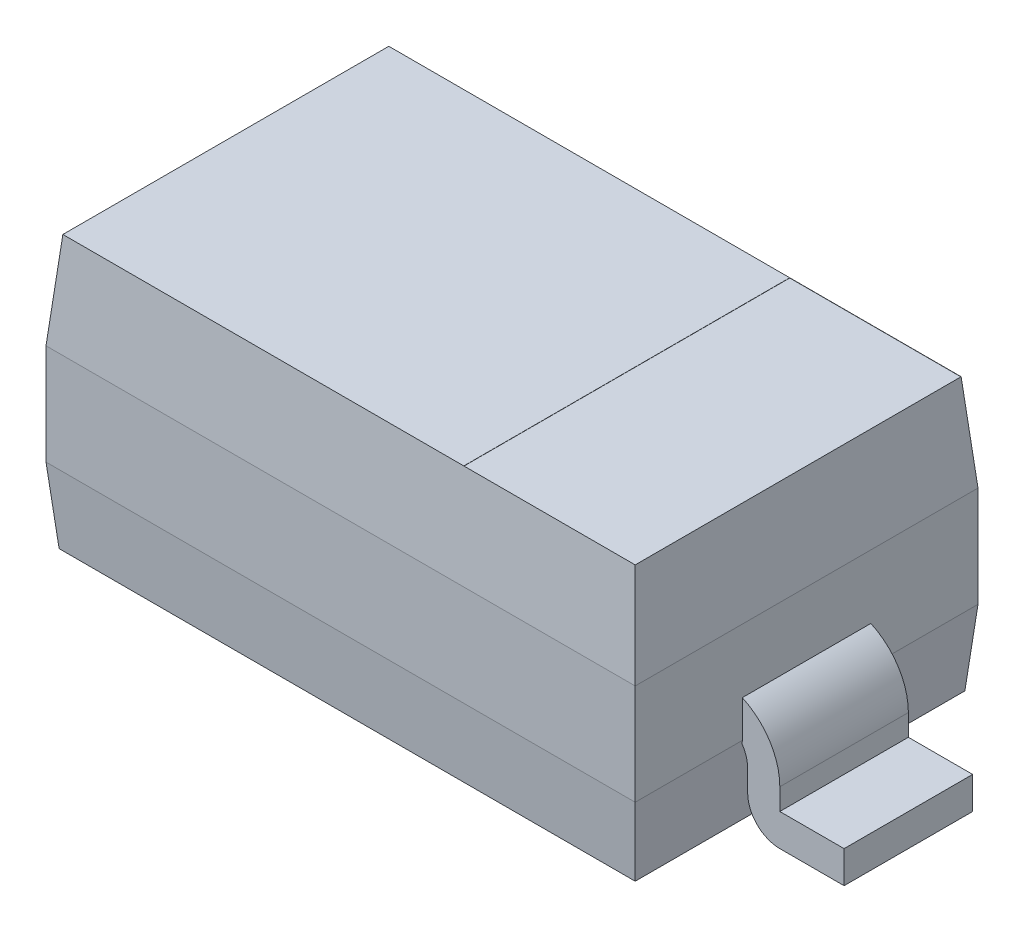
ISO-10303-21;
HEADER;
FILE_DESCRIPTION(('STEP AP214'),'2;1');
FILE_NAME('part.step','',(''),(''),'','','');
FILE_SCHEMA(('AUTOMOTIVE_DESIGN { 1 0 10303 214 1 1 1 1 }'));
ENDSEC;
DATA;
#1=APPLICATION_CONTEXT('core data for automotive mechanical design processes');
#2=APPLICATION_PROTOCOL_DEFINITION('international standard','automotive_design',2000,#1);
#3=PRODUCT_CONTEXT('',#1,'mechanical');
#4=PRODUCT('Part','Part','',(#3));
#5=PRODUCT_RELATED_PRODUCT_CATEGORY('part','',(#4));
#6=PRODUCT_DEFINITION_FORMATION('','',#4);
#7=PRODUCT_DEFINITION_CONTEXT('part definition',#1,'design');
#8=PRODUCT_DEFINITION('design','',#6,#7);
#9=PRODUCT_DEFINITION_SHAPE('','',#8);
#10=(LENGTH_UNIT() NAMED_UNIT(*) SI_UNIT(.MILLI.,.METRE.));
#11=(NAMED_UNIT(*) PLANE_ANGLE_UNIT() SI_UNIT($,.RADIAN.));
#12=(NAMED_UNIT(*) SI_UNIT($,.STERADIAN.) SOLID_ANGLE_UNIT());
#13=UNCERTAINTY_MEASURE_WITH_UNIT(LENGTH_MEASURE(1.E-05),#10,'distance_accuracy_value','');
#14=(GEOMETRIC_REPRESENTATION_CONTEXT(3) GLOBAL_UNCERTAINTY_ASSIGNED_CONTEXT((#13)) GLOBAL_UNIT_ASSIGNED_CONTEXT((#10,
#11,#12)) REPRESENTATION_CONTEXT('',''));
#15=CARTESIAN_POINT('',(0.,0.,0.));
#16=DIRECTION('',(0.,0.,1.));
#17=DIRECTION('',(1.,0.,0.));
#18=AXIS2_PLACEMENT_3D('',#15,#16,#17);
#19=CARTESIAN_POINT('',(-1.375,1.27,-0.8));
#20=DIRECTION('',(1.,0.,0.));
#21=DIRECTION('',(0.,0.,-1.));
#22=AXIS2_PLACEMENT_3D('',#19,#20,#21);
#23=PLANE('',#22);
#24=DIRECTION('',(0.,1.,0.));
#25=VECTOR('',#24,1.);
#26=CARTESIAN_POINT('',(-1.375,1.27,0.3));
#27=LINE('',#26,#25);
#28=CARTESIAN_POINT('',(-1.375,0.350000000000015,0.3));
#29=VERTEX_POINT('',#28);
#30=CARTESIAN_POINT('',(-1.375,0.522717802865893,0.3));
#31=VERTEX_POINT('',#30);
#32=EDGE_CURVE('E392',#29,#31,#27,.T.);
#33=ORIENTED_EDGE('',*,*,#32,.F.);
#34=DIRECTION('',(0.,0.,1.));
#35=VECTOR('',#34,1.);
#36=CARTESIAN_POINT('',(-1.375,0.350000000000015,-0.8));
#37=LINE('',#36,#35);
#38=CARTESIAN_POINT('',(-1.375,0.350000000000015,0.8));
#39=VERTEX_POINT('',#38);
#40=EDGE_CURVE('E463',#29,#39,#37,.T.);
#41=ORIENTED_EDGE('',*,*,#40,.T.);
#42=DIRECTION('',(0.,-1.,0.));
#43=VECTOR('',#42,1.);
#44=CARTESIAN_POINT('',(-1.375,1.27,0.8));
#45=LINE('',#44,#43);
#46=CARTESIAN_POINT('',(-1.375,0.819999999999983,0.8));
#47=VERTEX_POINT('',#46);
#48=EDGE_CURVE('E410',#47,#39,#45,.T.);
#49=ORIENTED_EDGE('',*,*,#48,.F.);
#50=DIRECTION('',(0.,0.,-1.));
#51=VECTOR('',#50,1.);
#52=CARTESIAN_POINT('',(-1.375,0.819999999999983,-0.8));
#53=LINE('',#52,#51);
#54=CARTESIAN_POINT('',(-1.375,0.819999999999983,-0.8));
#55=VERTEX_POINT('',#54);
#56=EDGE_CURVE('E426',#47,#55,#53,.T.);
#57=ORIENTED_EDGE('',*,*,#56,.T.);
#58=DIRECTION('',(0.,-1.,0.));
#59=VECTOR('',#58,1.);
#60=CARTESIAN_POINT('',(-1.375,1.27,-0.8));
#61=LINE('',#60,#59);
#62=CARTESIAN_POINT('',(-1.375,0.350000000000015,-0.8));
#63=VERTEX_POINT('',#62);
#64=EDGE_CURVE('E400',#55,#63,#61,.T.);
#65=ORIENTED_EDGE('',*,*,#64,.T.);
#66=CARTESIAN_POINT('',(-1.375,0.350000000000015,-0.3));
#67=VERTEX_POINT('',#66);
#68=EDGE_CURVE('E464',#63,#67,#37,.T.);
#69=ORIENTED_EDGE('',*,*,#68,.T.);
#70=DIRECTION('',(0.,1.,0.));
#71=VECTOR('',#70,1.);
#72=CARTESIAN_POINT('',(-1.375,1.27,-0.3));
#73=LINE('',#72,#71);
#74=CARTESIAN_POINT('',(-1.375,0.522717802865893,-0.3));
#75=VERTEX_POINT('',#74);
#76=EDGE_CURVE('E384',#67,#75,#73,.T.);
#77=ORIENTED_EDGE('',*,*,#76,.T.);
#78=DIRECTION('',(0.,0.,-1.));
#79=VECTOR('',#78,1.);
#80=CARTESIAN_POINT('',(-1.375,0.522717802865893,0.3));
#81=LINE('',#80,#79);
#82=EDGE_CURVE('E11',#31,#75,#81,.T.);
#83=ORIENTED_EDGE('',*,*,#82,.F.);
#84=EDGE_LOOP('',(#33,#41,#49,#57,#65,#69,#77,#83));
#85=FACE_BOUND('',#84,.T.);
#86=ADVANCED_FACE('F33',(#85),#23,.F.);
#87=CARTESIAN_POINT('',(1.375,1.27,-0.8));
#88=DIRECTION('',(-1.,0.,0.));
#89=DIRECTION('',(0.,0.,1.));
#90=AXIS2_PLACEMENT_3D('',#87,#88,#89);
#91=PLANE('',#90);
#92=DIRECTION('',(0.,-1.,0.));
#93=VECTOR('',#92,1.);
#94=CARTESIAN_POINT('',(1.375,1.27,0.3));
#95=LINE('',#94,#93);
#96=CARTESIAN_POINT('',(1.375,0.522717802865893,0.3));
#97=VERTEX_POINT('',#96);
#98=CARTESIAN_POINT('',(1.375,0.350000000000015,0.3));
#99=VERTEX_POINT('',#98);
#100=EDGE_CURVE('E396',#97,#99,#95,.T.);
#101=ORIENTED_EDGE('',*,*,#100,.F.);
#102=DIRECTION('',(0.,0.,-1.));
#103=VECTOR('',#102,1.);
#104=CARTESIAN_POINT('',(1.375,0.522717802865893,0.3));
#105=LINE('',#104,#103);
#106=CARTESIAN_POINT('',(1.375,0.522717802865893,-0.3));
#107=VERTEX_POINT('',#106);
#108=EDGE_CURVE('E41',#107,#97,#105,.F.);
#109=ORIENTED_EDGE('',*,*,#108,.F.);
#110=DIRECTION('',(0.,-1.,0.));
#111=VECTOR('',#110,1.);
#112=CARTESIAN_POINT('',(1.375,1.27,-0.3));
#113=LINE('',#112,#111);
#114=CARTESIAN_POINT('',(1.375,0.350000000000015,-0.3));
#115=VERTEX_POINT('',#114);
#116=EDGE_CURVE('E389',#107,#115,#113,.T.);
#117=ORIENTED_EDGE('',*,*,#116,.T.);
#118=DIRECTION('',(0.,0.,-1.));
#119=VECTOR('',#118,1.);
#120=CARTESIAN_POINT('',(1.375,0.350000000000015,-0.8));
#121=LINE('',#120,#119);
#122=CARTESIAN_POINT('',(1.375,0.350000000000015,-0.8));
#123=VERTEX_POINT('',#122);
#124=EDGE_CURVE('E457',#115,#123,#121,.T.);
#125=ORIENTED_EDGE('',*,*,#124,.T.);
#126=DIRECTION('',(0.,-1.,0.));
#127=VECTOR('',#126,1.);
#128=CARTESIAN_POINT('',(1.375,1.27,-0.8));
#129=LINE('',#128,#127);
#130=CARTESIAN_POINT('',(1.375,0.819999999999983,-0.8));
#131=VERTEX_POINT('',#130);
#132=EDGE_CURVE('E403',#131,#123,#129,.T.);
#133=ORIENTED_EDGE('',*,*,#132,.F.);
#134=DIRECTION('',(0.,0.,1.));
#135=VECTOR('',#134,1.);
#136=CARTESIAN_POINT('',(1.375,0.819999999999983,0.8));
#137=LINE('',#136,#135);
#138=CARTESIAN_POINT('',(1.375,0.819999999999983,0.8));
#139=VERTEX_POINT('',#138);
#140=EDGE_CURVE('E431',#131,#139,#137,.T.);
#141=ORIENTED_EDGE('',*,*,#140,.T.);
#142=DIRECTION('',(0.,-1.,0.));
#143=VECTOR('',#142,1.);
#144=CARTESIAN_POINT('',(1.375,1.27,0.8));
#145=LINE('',#144,#143);
#146=CARTESIAN_POINT('',(1.375,0.350000000000015,0.8));
#147=VERTEX_POINT('',#146);
#148=EDGE_CURVE('E407',#139,#147,#145,.T.);
#149=ORIENTED_EDGE('',*,*,#148,.T.);
#150=EDGE_CURVE('E458',#147,#99,#121,.T.);
#151=ORIENTED_EDGE('',*,*,#150,.T.);
#152=EDGE_LOOP('',(#101,#109,#117,#125,#133,#141,#149,#151));
#153=FACE_BOUND('',#152,.T.);
#154=ADVANCED_FACE('F506',(#153),#91,.F.);
#155=CARTESIAN_POINT('',(1.375,0.350000000000015,-0.8));
#156=DIRECTION('',(-0.996194698091746,0.0871557427476553,0.));
#157=DIRECTION('',(-0.0871557427476553,-0.996194698091746,0.));
#158=AXIS2_PLACEMENT_3D('',#155,#156,#157);
#159=PLANE('',#158);
#160=DIRECTION('',(0.,0.,-1.));
#161=VECTOR('',#160,1.);
#162=CARTESIAN_POINT('',(1.37367687103119,0.334876566683237,0.3));
#163=LINE('',#162,#161);
#164=CARTESIAN_POINT('',(1.37367687103119,0.334876566683237,0.3));
#165=VERTEX_POINT('',#164);
#166=CARTESIAN_POINT('',(1.37367687103119,0.334876566683237,-0.3));
#167=VERTEX_POINT('',#166);
#168=EDGE_CURVE('E483',#165,#167,#163,.T.);
#169=ORIENTED_EDGE('',*,*,#168,.F.);
#170=DIRECTION('',(-0.0871557427476553,-0.996194698091746,0.));
#171=VECTOR('',#170,1.);
#172=CARTESIAN_POINT('',(1.375,0.350000000000015,0.3));
#173=LINE('',#172,#171);
#174=EDGE_CURVE('E394',#165,#99,#173,.F.);
#175=ORIENTED_EDGE('',*,*,#174,.T.);
#176=ORIENTED_EDGE('',*,*,#150,.F.);
#177=DIRECTION('',(0.0868265938642448,0.992432509138968,0.0868265938642442));
#178=VECTOR('',#177,1.);
#179=CARTESIAN_POINT('',(1.35426814214432,0.113033780376138,0.779268142144317));
#180=LINE('',#179,#178);
#181=CARTESIAN_POINT('',(1.34437896776593,0.,0.769378967765927));
#182=VERTEX_POINT('',#181);
#183=EDGE_CURVE('E439',#147,#182,#180,.F.);
#184=ORIENTED_EDGE('',*,*,#183,.T.);
#185=DIRECTION('',(0.,0.,1.));
#186=VECTOR('',#185,1.);
#187=CARTESIAN_POINT('',(1.34437896776593,0.,0.8));
#188=LINE('',#187,#186);
#189=CARTESIAN_POINT('',(1.34437896776593,0.,-0.769378967765927));
#190=VERTEX_POINT('',#189);
#191=EDGE_CURVE('E452',#190,#182,#188,.T.);
#192=ORIENTED_EDGE('',*,*,#191,.F.);
#193=DIRECTION('',(0.0868265938642448,0.992432509138968,-0.0868265938642442));
#194=VECTOR('',#193,1.);
#195=CARTESIAN_POINT('',(1.375,0.350000000000015,-0.8));
#196=LINE('',#195,#194);
#197=EDGE_CURVE('E469',#123,#190,#196,.F.);
#198=ORIENTED_EDGE('',*,*,#197,.F.);
#199=ORIENTED_EDGE('',*,*,#124,.F.);
#200=DIRECTION('',(-0.0871557427476553,-0.996194698091746,0.));
#201=VECTOR('',#200,1.);
#202=CARTESIAN_POINT('',(1.375,0.350000000000015,-0.3));
#203=LINE('',#202,#201);
#204=EDGE_CURVE('E386',#167,#115,#203,.F.);
#205=ORIENTED_EDGE('',*,*,#204,.F.);
#206=EDGE_LOOP('',(#169,#175,#176,#184,#192,#198,#199,#205));
#207=FACE_BOUND('',#206,.T.);
#208=ADVANCED_FACE('F517',(#207),#159,.F.);
#209=CARTESIAN_POINT('',(-1.375,0.350000000000015,-0.8));
#210=DIRECTION('',(0.996194698091746,0.0871557427476547,0.));
#211=DIRECTION('',(-0.0871557427476547,0.996194698091746,0.));
#212=AXIS2_PLACEMENT_3D('',#209,#210,#211);
#213=PLANE('',#212);
#214=ORIENTED_EDGE('',*,*,#40,.F.);
#215=DIRECTION('',(-0.0871557427476547,0.996194698091746,0.));
#216=VECTOR('',#215,1.);
#217=CARTESIAN_POINT('',(-1.375,0.350000000000015,0.3));
#218=LINE('',#217,#216);
#219=CARTESIAN_POINT('',(-1.37367687103119,0.334876566683237,0.3));
#220=VERTEX_POINT('',#219);
#221=EDGE_CURVE('E481',#29,#220,#218,.F.);
#222=ORIENTED_EDGE('',*,*,#221,.T.);
#223=DIRECTION('',(0.,0.,-1.));
#224=VECTOR('',#223,1.);
#225=CARTESIAN_POINT('',(-1.37367687103119,0.334876566683237,0.3));
#226=LINE('',#225,#224);
#227=CARTESIAN_POINT('',(-1.37367687103119,0.334876566683237,-0.3));
#228=VERTEX_POINT('',#227);
#229=EDGE_CURVE('E478',#228,#220,#226,.F.);
#230=ORIENTED_EDGE('',*,*,#229,.F.);
#231=DIRECTION('',(-0.0871557427476547,0.996194698091746,0.));
#232=VECTOR('',#231,1.);
#233=CARTESIAN_POINT('',(-1.375,0.350000000000015,-0.3));
#234=LINE('',#233,#232);
#235=EDGE_CURVE('E467',#67,#228,#234,.F.);
#236=ORIENTED_EDGE('',*,*,#235,.F.);
#237=ORIENTED_EDGE('',*,*,#68,.F.);
#238=DIRECTION('',(0.0868265938642442,-0.992432509138968,0.0868265938642442));
#239=VECTOR('',#238,1.);
#240=CARTESIAN_POINT('',(-1.375,0.350000000000015,-0.8));
#241=LINE('',#240,#239);
#242=CARTESIAN_POINT('',(-1.34437896776593,0.,-0.769378967765927));
#243=VERTEX_POINT('',#242);
#244=EDGE_CURVE('E399',#243,#63,#241,.F.);
#245=ORIENTED_EDGE('',*,*,#244,.F.);
#246=DIRECTION('',(0.,0.,-1.));
#247=VECTOR('',#246,1.);
#248=CARTESIAN_POINT('',(-1.34437896776593,0.,0.8));
#249=LINE('',#248,#247);
#250=CARTESIAN_POINT('',(-1.34437896776593,0.,0.769378967765927));
#251=VERTEX_POINT('',#250);
#252=EDGE_CURVE('E448',#251,#243,#249,.T.);
#253=ORIENTED_EDGE('',*,*,#252,.F.);
#254=DIRECTION('',(-0.0868265938642442,0.992432509138968,0.0868265938642442));
#255=VECTOR('',#254,1.);
#256=CARTESIAN_POINT('',(-1.36293782815669,0.212128744946124,0.787937828156694));
#257=LINE('',#256,#255);
#258=EDGE_CURVE('E471',#251,#39,#257,.T.);
#259=ORIENTED_EDGE('',*,*,#258,.T.);
#260=EDGE_LOOP('',(#214,#222,#230,#236,#237,#245,#253,#259));
#261=FACE_BOUND('',#260,.T.);
#262=ADVANCED_FACE('F526',(#261),#213,.F.);
#263=CARTESIAN_POINT('',(-1.375,1.27,0.8));
#264=DIRECTION('',(0.,0.,-1.));
#265=DIRECTION('',(-1.,0.,0.));
#266=AXIS2_PLACEMENT_3D('',#263,#264,#265);
#267=PLANE('',#266);
#268=ORIENTED_EDGE('',*,*,#48,.T.);
#269=DIRECTION('',(1.,0.,0.));
#270=VECTOR('',#269,1.);
#271=CARTESIAN_POINT('',(-1.375,0.350000000000015,0.8));
#272=LINE('',#271,#270);
#273=EDGE_CURVE('E461',#39,#147,#272,.T.);
#274=ORIENTED_EDGE('',*,*,#273,.T.);
#275=ORIENTED_EDGE('',*,*,#148,.F.);
#276=DIRECTION('',(-1.,0.,0.));
#277=VECTOR('',#276,1.);
#278=CARTESIAN_POINT('',(-1.375,0.819999999999983,0.8));
#279=LINE('',#278,#277);
#280=EDGE_CURVE('E429',#139,#47,#279,.T.);
#281=ORIENTED_EDGE('',*,*,#280,.T.);
#282=EDGE_LOOP('',(#268,#274,#275,#281));
#283=FACE_BOUND('',#282,.T.);
#284=ADVANCED_FACE('F558',(#283),#267,.F.);
#285=CARTESIAN_POINT('',(-1.375,1.27,-0.8));
#286=DIRECTION('',(0.,0.,1.));
#287=DIRECTION('',(1.,0.,0.));
#288=AXIS2_PLACEMENT_3D('',#285,#286,#287);
#289=PLANE('',#288);
#290=ORIENTED_EDGE('',*,*,#132,.T.);
#291=DIRECTION('',(-1.,0.,0.));
#292=VECTOR('',#291,1.);
#293=CARTESIAN_POINT('',(-1.375,0.350000000000015,-0.8));
#294=LINE('',#293,#292);
#295=EDGE_CURVE('E435',#123,#63,#294,.T.);
#296=ORIENTED_EDGE('',*,*,#295,.T.);
#297=ORIENTED_EDGE('',*,*,#64,.F.);
#298=DIRECTION('',(1.,0.,0.));
#299=VECTOR('',#298,1.);
#300=CARTESIAN_POINT('',(1.375,0.819999999999983,-0.8));
#301=LINE('',#300,#299);
#302=EDGE_CURVE('E433',#55,#131,#301,.T.);
#303=ORIENTED_EDGE('',*,*,#302,.T.);
#304=EDGE_LOOP('',(#290,#296,#297,#303));
#305=FACE_BOUND('',#304,.T.);
#306=ADVANCED_FACE('F512',(#305),#289,.F.);
#307=CARTESIAN_POINT('',(-1.375,1.27,0.8));
#308=DIRECTION('',(0.,1.,0.));
#309=DIRECTION('',(0.,0.,1.));
#310=AXIS2_PLACEMENT_3D('',#307,#308,#309);
#311=PLANE('',#310);
#312=DIRECTION('',(0.,0.,1.));
#313=VECTOR('',#312,1.);
#314=CARTESIAN_POINT('',(0.535630101413334,1.27,0.760630101413334));
#315=LINE('',#314,#313);
#316=CARTESIAN_POINT('',(0.535630101413334,1.27,-0.760630101413334));
#317=VERTEX_POINT('',#316);
#318=CARTESIAN_POINT('',(0.535630101413334,1.27,0.760630101413334));
#319=VERTEX_POINT('',#318);
#320=EDGE_CURVE('E48',#317,#319,#315,.T.);
#321=ORIENTED_EDGE('',*,*,#320,.F.);
#322=DIRECTION('',(-1.,0.,0.));
#323=VECTOR('',#322,1.);
#324=CARTESIAN_POINT('',(-1.375,1.27,-0.760630101413334));
#325=LINE('',#324,#323);
#326=CARTESIAN_POINT('',(-1.33563010141333,1.27,-0.760630101413334));
#327=VERTEX_POINT('',#326);
#328=EDGE_CURVE('E413',#317,#327,#325,.T.);
#329=ORIENTED_EDGE('',*,*,#328,.T.);
#330=DIRECTION('',(0.,0.,1.));
#331=VECTOR('',#330,1.);
#332=CARTESIAN_POINT('',(-1.33563010141333,1.27,0.8));
#333=LINE('',#332,#331);
#334=CARTESIAN_POINT('',(-1.33563010141333,1.27,0.760630101413334));
#335=VERTEX_POINT('',#334);
#336=EDGE_CURVE('E423',#327,#335,#333,.T.);
#337=ORIENTED_EDGE('',*,*,#336,.T.);
#338=DIRECTION('',(1.,0.,0.));
#339=VECTOR('',#338,1.);
#340=CARTESIAN_POINT('',(1.375,1.27,0.760630101413334));
#341=LINE('',#340,#339);
#342=EDGE_CURVE('E420',#335,#319,#341,.T.);
#343=ORIENTED_EDGE('',*,*,#342,.T.);
#344=EDGE_LOOP('',(#321,#329,#337,#343));
#345=FACE_BOUND('',#344,.T.);
#346=ADVANCED_FACE('F573',(#345),#311,.T.);
#347=CARTESIAN_POINT('',(-1.375,0.,0.8));
#348=DIRECTION('',(0.,1.,0.));
#349=DIRECTION('',(0.,0.,1.));
#350=AXIS2_PLACEMENT_3D('',#347,#348,#349);
#351=PLANE('',#350);
#352=ORIENTED_EDGE('',*,*,#252,.T.);
#353=DIRECTION('',(1.,0.,0.));
#354=VECTOR('',#353,1.);
#355=CARTESIAN_POINT('',(-1.375,0.,-0.769378967765927));
#356=LINE('',#355,#354);
#357=EDGE_CURVE('E454',#243,#190,#356,.T.);
#358=ORIENTED_EDGE('',*,*,#357,.T.);
#359=ORIENTED_EDGE('',*,*,#191,.T.);
#360=DIRECTION('',(-1.,0.,0.));
#361=VECTOR('',#360,1.);
#362=CARTESIAN_POINT('',(-1.375,0.,0.769378967765927));
#363=LINE('',#362,#361);
#364=EDGE_CURVE('E450',#182,#251,#363,.T.);
#365=ORIENTED_EDGE('',*,*,#364,.T.);
#366=EDGE_LOOP('',(#352,#358,#359,#365));
#367=FACE_BOUND('',#366,.T.);
#368=ADVANCED_FACE('F607',(#367),#351,.F.);
#369=CARTESIAN_POINT('',(1.33563010141333,1.27,0.8));
#370=DIRECTION('',(0.996194698091746,0.0871557427476554,0.));
#371=DIRECTION('',(-0.0871557427476554,0.996194698091746,0.));
#372=AXIS2_PLACEMENT_3D('',#369,#370,#371);
#373=PLANE('',#372);
#374=DIRECTION('',(0.0868265938642448,-0.992432509138968,0.0868265938642444));
#375=VECTOR('',#374,1.);
#376=CARTESIAN_POINT('',(1.33592690546471,1.26660751416907,0.760926905464713));
#377=LINE('',#376,#375);
#378=CARTESIAN_POINT('',(1.33563010141333,1.27,0.760630101413334));
#379=VERTEX_POINT('',#378);
#380=EDGE_CURVE('E441',#139,#379,#377,.F.);
#381=ORIENTED_EDGE('',*,*,#380,.F.);
#382=ORIENTED_EDGE('',*,*,#140,.F.);
#383=DIRECTION('',(0.0868265938642448,-0.992432509138968,-0.0868265938642444));
#384=VECTOR('',#383,1.);
#385=CARTESIAN_POINT('',(1.31519504760903,1.50357373379295,-0.74019504760903));
#386=LINE('',#385,#384);
#387=CARTESIAN_POINT('',(1.33563010141333,1.27,-0.760630101413334));
#388=VERTEX_POINT('',#387);
#389=EDGE_CURVE('E404',#388,#131,#386,.T.);
#390=ORIENTED_EDGE('',*,*,#389,.F.);
#391=DIRECTION('',(0.,0.,-1.));
#392=VECTOR('',#391,1.);
#393=CARTESIAN_POINT('',(1.33563010141333,1.27,-0.8));
#394=LINE('',#393,#392);
#395=EDGE_CURVE('E417',#379,#388,#394,.T.);
#396=ORIENTED_EDGE('',*,*,#395,.F.);
#397=EDGE_LOOP('',(#381,#382,#390,#396));
#398=FACE_BOUND('',#397,.T.);
#399=ADVANCED_FACE('F562',(#398),#373,.T.);
#400=CARTESIAN_POINT('',(-1.375,1.27,-0.760630101413334));
#401=DIRECTION('',(0.,0.0871557427476549,-0.996194698091746));
#402=DIRECTION('',(0.,0.996194698091746,0.0871557427476549));
#403=AXIS2_PLACEMENT_3D('',#400,#401,#402);
#404=PLANE('',#403);
#405=ORIENTED_EDGE('',*,*,#389,.T.);
#406=ORIENTED_EDGE('',*,*,#302,.F.);
#407=DIRECTION('',(0.0868265938642444,0.992432509138968,0.0868265938642444));
#408=VECTOR('',#407,1.);
#409=CARTESIAN_POINT('',(-1.33592690546471,1.26660751416907,-0.760926905464713));
#410=LINE('',#409,#408);
#411=EDGE_CURVE('E438',#327,#55,#410,.F.);
#412=ORIENTED_EDGE('',*,*,#411,.F.);
#413=ORIENTED_EDGE('',*,*,#328,.F.);
#414=EDGE_CURVE('E414',#388,#317,#325,.T.);
#415=ORIENTED_EDGE('',*,*,#414,.F.);
#416=EDGE_LOOP('',(#405,#406,#412,#413,#415));
#417=FACE_BOUND('',#416,.T.);
#418=ADVANCED_FACE('F567',(#417),#404,.T.);
#419=CARTESIAN_POINT('',(-1.375,1.27,0.760630101413334));
#420=DIRECTION('',(0.,0.0871557427476549,0.996194698091746));
#421=DIRECTION('',(0.,-0.996194698091746,0.0871557427476549));
#422=AXIS2_PLACEMENT_3D('',#419,#420,#421);
#423=PLANE('',#422);
#424=ORIENTED_EDGE('',*,*,#380,.T.);
#425=DIRECTION('',(1.,0.,0.));
#426=VECTOR('',#425,1.);
#427=CARTESIAN_POINT('',(0.535630101413334,1.27,0.760630101413334));
#428=LINE('',#427,#426);
#429=EDGE_CURVE('E254',#319,#379,#428,.T.);
#430=ORIENTED_EDGE('',*,*,#429,.F.);
#431=ORIENTED_EDGE('',*,*,#342,.F.);
#432=DIRECTION('',(-0.0868265938642444,-0.992432509138968,0.0868265938642444));
#433=VECTOR('',#432,1.);
#434=CARTESIAN_POINT('',(-1.33592690546471,1.26660751416907,0.760926905464713));
#435=LINE('',#434,#433);
#436=EDGE_CURVE('E436',#47,#335,#435,.F.);
#437=ORIENTED_EDGE('',*,*,#436,.F.);
#438=ORIENTED_EDGE('',*,*,#280,.F.);
#439=EDGE_LOOP('',(#424,#430,#431,#437,#438));
#440=FACE_BOUND('',#439,.T.);
#441=ADVANCED_FACE('F578',(#440),#423,.T.);
#442=CARTESIAN_POINT('',(-1.33563010141333,1.27,0.8));
#443=DIRECTION('',(-0.996194698091746,0.0871557427476549,0.));
#444=DIRECTION('',(-0.0871557427476549,-0.996194698091746,0.));
#445=AXIS2_PLACEMENT_3D('',#442,#443,#444);
#446=PLANE('',#445);
#447=ORIENTED_EDGE('',*,*,#411,.T.);
#448=ORIENTED_EDGE('',*,*,#56,.F.);
#449=ORIENTED_EDGE('',*,*,#436,.T.);
#450=ORIENTED_EDGE('',*,*,#336,.F.);
#451=EDGE_LOOP('',(#447,#448,#449,#450));
#452=FACE_BOUND('',#451,.T.);
#453=ADVANCED_FACE('F597',(#452),#446,.T.);
#454=CARTESIAN_POINT('',(-1.375,0.350000000000015,0.8));
#455=DIRECTION('',(0.,0.0871557427476547,-0.996194698091746));
#456=DIRECTION('',(0.,0.996194698091746,0.0871557427476547));
#457=AXIS2_PLACEMENT_3D('',#454,#455,#456);
#458=PLANE('',#457);
#459=ORIENTED_EDGE('',*,*,#258,.F.);
#460=ORIENTED_EDGE('',*,*,#364,.F.);
#461=ORIENTED_EDGE('',*,*,#183,.F.);
#462=ORIENTED_EDGE('',*,*,#273,.F.);
#463=EDGE_LOOP('',(#459,#460,#461,#462));
#464=FACE_BOUND('',#463,.T.);
#465=ADVANCED_FACE('F35',(#464),#458,.F.);
#466=CARTESIAN_POINT('',(-1.375,0.350000000000015,-0.8));
#467=DIRECTION('',(0.,0.0871557427476547,0.996194698091746));
#468=DIRECTION('',(0.,-0.996194698091746,0.0871557427476547));
#469=AXIS2_PLACEMENT_3D('',#466,#467,#468);
#470=PLANE('',#469);
#471=ORIENTED_EDGE('',*,*,#197,.T.);
#472=ORIENTED_EDGE('',*,*,#357,.F.);
#473=ORIENTED_EDGE('',*,*,#244,.T.);
#474=ORIENTED_EDGE('',*,*,#295,.F.);
#475=EDGE_LOOP('',(#471,#472,#473,#474));
#476=FACE_BOUND('',#475,.T.);
#477=ADVANCED_FACE('F520',(#476),#470,.F.);
#478=CARTESIAN_POINT('',(-1.55,0.250000000000001,0.3));
#479=DIRECTION('',(1.,0.,0.));
#480=DIRECTION('',(0.,1.,0.));
#481=AXIS2_PLACEMENT_3D('',#478,#479,#480);
#482=PLANE('',#481);
#483=DIRECTION('',(0.,0.,-1.));
#484=VECTOR('',#483,1.);
#485=CARTESIAN_POINT('',(-1.55,0.250000000000001,0.3));
#486=LINE('',#485,#484);
#487=CARTESIAN_POINT('',(-1.55,0.250000000000001,0.3));
#488=VERTEX_POINT('',#487);
#489=CARTESIAN_POINT('',(-1.55,0.250000000000001,-0.3));
#490=VERTEX_POINT('',#489);
#491=EDGE_CURVE('E356',#488,#490,#486,.T.);
#492=ORIENTED_EDGE('',*,*,#491,.T.);
#493=DIRECTION('',(0.,-1.,0.));
#494=VECTOR('',#493,1.);
#495=CARTESIAN_POINT('',(-1.55,0.250000000000001,-0.3));
#496=LINE('',#495,#494);
#497=CARTESIAN_POINT('',(-1.55,0.15,-0.3));
#498=VERTEX_POINT('',#497);
#499=EDGE_CURVE('E309',#490,#498,#496,.T.);
#500=ORIENTED_EDGE('',*,*,#499,.T.);
#501=DIRECTION('',(0.,0.,-1.));
#502=VECTOR('',#501,1.);
#503=CARTESIAN_POINT('',(-1.55,0.15,0.3));
#504=LINE('',#503,#502);
#505=CARTESIAN_POINT('',(-1.55,0.15,0.3));
#506=VERTEX_POINT('',#505);
#507=EDGE_CURVE('E354',#506,#498,#504,.T.);
#508=ORIENTED_EDGE('',*,*,#507,.F.);
#509=DIRECTION('',(0.,-1.,0.));
#510=VECTOR('',#509,1.);
#511=CARTESIAN_POINT('',(-1.55,0.250000000000001,0.3));
#512=LINE('',#511,#510);
#513=EDGE_CURVE('E352',#488,#506,#512,.T.);
#514=ORIENTED_EDGE('',*,*,#513,.F.);
#515=EDGE_LOOP('',(#492,#500,#508,#514));
#516=FACE_BOUND('',#515,.T.);
#517=ADVANCED_FACE('F540',(#516),#482,.F.);
#518=CARTESIAN_POINT('',(-1.55,0.15,0.3));
#519=DIRECTION('',(0.,-1.,0.));
#520=DIRECTION('',(1.,0.,0.));
#521=AXIS2_PLACEMENT_3D('',#518,#519,#520);
#522=PLANE('',#521);
#523=ORIENTED_EDGE('',*,*,#507,.T.);
#524=DIRECTION('',(-1.,0.,0.));
#525=VECTOR('',#524,1.);
#526=CARTESIAN_POINT('',(-1.55,0.15,-0.3));
#527=LINE('',#526,#525);
#528=CARTESIAN_POINT('',(-1.85,0.149999999999999,-0.3));
#529=VERTEX_POINT('',#528);
#530=EDGE_CURVE('E263',#498,#529,#527,.T.);
#531=ORIENTED_EDGE('',*,*,#530,.T.);
#532=DIRECTION('',(0.,0.,-1.));
#533=VECTOR('',#532,1.);
#534=CARTESIAN_POINT('',(-1.85,0.149999999999999,0.3));
#535=LINE('',#534,#533);
#536=CARTESIAN_POINT('',(-1.85,0.149999999999999,0.3));
#537=VERTEX_POINT('',#536);
#538=EDGE_CURVE('E382',#537,#529,#535,.T.);
#539=ORIENTED_EDGE('',*,*,#538,.F.);
#540=DIRECTION('',(-1.,0.,0.));
#541=VECTOR('',#540,1.);
#542=CARTESIAN_POINT('',(-1.55,0.15,0.3));
#543=LINE('',#542,#541);
#544=EDGE_CURVE('E312',#506,#537,#543,.T.);
#545=ORIENTED_EDGE('',*,*,#544,.F.);
#546=EDGE_LOOP('',(#523,#531,#539,#545));
#547=FACE_BOUND('',#546,.T.);
#548=ADVANCED_FACE('F678',(#547),#522,.F.);
#549=CARTESIAN_POINT('',(-1.85,0.,0.3));
#550=DIRECTION('',(-1.,0.,0.));
#551=DIRECTION('',(0.,-1.,0.));
#552=AXIS2_PLACEMENT_3D('',#549,#550,#551);
#553=PLANE('',#552);
#554=ORIENTED_EDGE('',*,*,#538,.T.);
#555=DIRECTION('',(0.,1.,0.));
#556=VECTOR('',#555,1.);
#557=CARTESIAN_POINT('',(-1.85,0.,-0.3));
#558=LINE('',#557,#556);
#559=CARTESIAN_POINT('',(-1.85,0.,-0.3));
#560=VERTEX_POINT('',#559);
#561=EDGE_CURVE('E269',#560,#529,#558,.T.);
#562=ORIENTED_EDGE('',*,*,#561,.F.);
#563=DIRECTION('',(0.,0.,-1.));
#564=VECTOR('',#563,1.);
#565=CARTESIAN_POINT('',(-1.85,0.,0.3));
#566=LINE('',#565,#564);
#567=CARTESIAN_POINT('',(-1.85,0.,0.3));
#568=VERTEX_POINT('',#567);
#569=EDGE_CURVE('E380',#568,#560,#566,.T.);
#570=ORIENTED_EDGE('',*,*,#569,.F.);
#571=DIRECTION('',(0.,1.,0.));
#572=VECTOR('',#571,1.);
#573=CARTESIAN_POINT('',(-1.85,0.,0.3));
#574=LINE('',#573,#572);
#575=EDGE_CURVE('E314',#568,#537,#574,.T.);
#576=ORIENTED_EDGE('',*,*,#575,.T.);
#577=EDGE_LOOP('',(#554,#562,#570,#576));
#578=FACE_BOUND('',#577,.T.);
#579=ADVANCED_FACE('F685',(#578),#553,.T.);
#580=CARTESIAN_POINT('',(-1.55,0.,0.3));
#581=DIRECTION('',(0.,-1.,0.));
#582=DIRECTION('',(1.,0.,0.));
#583=AXIS2_PLACEMENT_3D('',#580,#581,#582);
#584=PLANE('',#583);
#585=ORIENTED_EDGE('',*,*,#569,.T.);
#586=DIRECTION('',(-1.,0.,0.));
#587=VECTOR('',#586,1.);
#588=CARTESIAN_POINT('',(-1.55,0.,-0.3));
#589=LINE('',#588,#587);
#590=CARTESIAN_POINT('',(-1.55,0.,-0.3));
#591=VERTEX_POINT('',#590);
#592=EDGE_CURVE('E272',#591,#560,#589,.T.);
#593=ORIENTED_EDGE('',*,*,#592,.F.);
#594=DIRECTION('',(0.,0.,-1.));
#595=VECTOR('',#594,1.);
#596=CARTESIAN_POINT('',(-1.55,0.,0.3));
#597=LINE('',#596,#595);
#598=CARTESIAN_POINT('',(-1.55,0.,0.3));
#599=VERTEX_POINT('',#598);
#600=EDGE_CURVE('E378',#599,#591,#597,.T.);
#601=ORIENTED_EDGE('',*,*,#600,.F.);
#602=DIRECTION('',(-1.,0.,0.));
#603=VECTOR('',#602,1.);
#604=CARTESIAN_POINT('',(-1.55,0.,0.3));
#605=LINE('',#604,#603);
#606=EDGE_CURVE('E317',#599,#568,#605,.T.);
#607=ORIENTED_EDGE('',*,*,#606,.T.);
#608=EDGE_LOOP('',(#585,#593,#601,#607));
#609=FACE_BOUND('',#608,.T.);
#610=ADVANCED_FACE('F693',(#609),#584,.T.);
#611=CARTESIAN_POINT('',(-1.55,0.15,0.3));
#612=DIRECTION('',(0.,0.,-1.));
#613=DIRECTION('',(-1.,0.,0.));
#614=AXIS2_PLACEMENT_3D('',#611,#612,#613);
#615=CYLINDRICAL_SURFACE('',#614,0.15);
#616=ORIENTED_EDGE('',*,*,#600,.T.);
#617=CARTESIAN_POINT('',(-1.55,0.15,-0.3));
#618=DIRECTION('',(0.,0.,-1.));
#619=DIRECTION('',(-1.,0.,0.));
#620=AXIS2_PLACEMENT_3D('',#617,#618,#619);
#621=CIRCLE('',#620,0.15);
#622=CARTESIAN_POINT('',(-1.4,0.15,-0.3));
#623=VERTEX_POINT('',#622);
#624=EDGE_CURVE('E275',#623,#591,#621,.T.);
#625=ORIENTED_EDGE('',*,*,#624,.F.);
#626=DIRECTION('',(0.,0.,-1.));
#627=VECTOR('',#626,1.);
#628=CARTESIAN_POINT('',(-1.4,0.15,0.3));
#629=LINE('',#628,#627);
#630=CARTESIAN_POINT('',(-1.4,0.15,0.3));
#631=VERTEX_POINT('',#630);
#632=EDGE_CURVE('E376',#631,#623,#629,.T.);
#633=ORIENTED_EDGE('',*,*,#632,.F.);
#634=CARTESIAN_POINT('',(-1.55,0.15,0.3));
#635=DIRECTION('',(0.,0.,-1.));
#636=DIRECTION('',(-1.,0.,0.));
#637=AXIS2_PLACEMENT_3D('',#634,#635,#636);
#638=CIRCLE('',#637,0.15);
#639=EDGE_CURVE('E320',#631,#599,#638,.T.);
#640=ORIENTED_EDGE('',*,*,#639,.T.);
#641=EDGE_LOOP('',(#616,#625,#633,#640));
#642=FACE_BOUND('',#641,.T.);
#643=ADVANCED_FACE('F701',(#642),#615,.T.);
#644=CARTESIAN_POINT('',(-1.4,0.25,0.3));
#645=DIRECTION('',(1.,0.,0.));
#646=DIRECTION('',(0.,1.,0.));
#647=AXIS2_PLACEMENT_3D('',#644,#645,#646);
#648=PLANE('',#647);
#649=ORIENTED_EDGE('',*,*,#632,.T.);
#650=DIRECTION('',(0.,-1.,0.));
#651=VECTOR('',#650,1.);
#652=CARTESIAN_POINT('',(-1.4,0.25,-0.3));
#653=LINE('',#652,#651);
#654=CARTESIAN_POINT('',(-1.4,0.25,-0.3));
#655=VERTEX_POINT('',#654);
#656=EDGE_CURVE('E278',#655,#623,#653,.T.);
#657=ORIENTED_EDGE('',*,*,#656,.F.);
#658=DIRECTION('',(0.,0.,-1.));
#659=VECTOR('',#658,1.);
#660=CARTESIAN_POINT('',(-1.4,0.25,0.3));
#661=LINE('',#660,#659);
#662=CARTESIAN_POINT('',(-1.4,0.25,0.3));
#663=VERTEX_POINT('',#662);
#664=EDGE_CURVE('E373',#663,#655,#661,.T.);
#665=ORIENTED_EDGE('',*,*,#664,.F.);
#666=DIRECTION('',(0.,-1.,0.));
#667=VECTOR('',#666,1.);
#668=CARTESIAN_POINT('',(-1.4,0.25,0.3));
#669=LINE('',#668,#667);
#670=EDGE_CURVE('E323',#663,#631,#669,.T.);
#671=ORIENTED_EDGE('',*,*,#670,.T.);
#672=EDGE_LOOP('',(#649,#657,#665,#671));
#673=FACE_BOUND('',#672,.T.);
#674=ADVANCED_FACE('F709',(#673),#648,.T.);
#675=CARTESIAN_POINT('',(-1.55,0.15,0.3));
#676=DIRECTION('',(0.,0.,-1.));
#677=DIRECTION('',(-1.,0.,0.));
#678=AXIS2_PLACEMENT_3D('',#675,#676,#677);
#679=PLANE('',#678);
#680=ORIENTED_EDGE('',*,*,#221,.F.);
#681=ORIENTED_EDGE('',*,*,#32,.T.);
#682=CARTESIAN_POINT('',(-1.25,0.25,0.3));
#683=DIRECTION('',(0.,0.,1.));
#684=DIRECTION('',(1.,0.,0.));
#685=AXIS2_PLACEMENT_3D('',#682,#683,#684);
#686=CIRCLE('',#685,0.3);
#687=EDGE_CURVE('E350',#31,#488,#686,.T.);
#688=ORIENTED_EDGE('',*,*,#687,.T.);
#689=ORIENTED_EDGE('',*,*,#513,.T.);
#690=ORIENTED_EDGE('',*,*,#544,.T.);
#691=ORIENTED_EDGE('',*,*,#575,.F.);
#692=ORIENTED_EDGE('',*,*,#606,.F.);
#693=ORIENTED_EDGE('',*,*,#639,.F.);
#694=ORIENTED_EDGE('',*,*,#670,.F.);
#695=CARTESIAN_POINT('',(-1.25,0.25,0.3));
#696=DIRECTION('',(0.,0.,1.));
#697=DIRECTION('',(1.,0.,0.));
#698=AXIS2_PLACEMENT_3D('',#695,#696,#697);
#699=CIRCLE('',#698,0.15);
#700=EDGE_CURVE('E326',#220,#663,#699,.T.);
#701=ORIENTED_EDGE('',*,*,#700,.F.);
#702=EDGE_LOOP('',(#680,#681,#688,#689,#690,#691,#692,#693,#694,#701));
#703=FACE_BOUND('',#702,.T.);
#704=ADVANCED_FACE('F545',(#703),#679,.F.);
#705=CARTESIAN_POINT('',(-1.55,0.15,-0.3));
#706=DIRECTION('',(0.,0.,-1.));
#707=DIRECTION('',(-1.,0.,0.));
#708=AXIS2_PLACEMENT_3D('',#705,#706,#707);
#709=PLANE('',#708);
#710=ORIENTED_EDGE('',*,*,#76,.F.);
#711=ORIENTED_EDGE('',*,*,#235,.T.);
#712=CARTESIAN_POINT('',(-1.25,0.25,-0.3));
#713=DIRECTION('',(0.,0.,1.));
#714=DIRECTION('',(1.,0.,0.));
#715=AXIS2_PLACEMENT_3D('',#712,#713,#714);
#716=CIRCLE('',#715,0.15);
#717=EDGE_CURVE('E281',#228,#655,#716,.T.);
#718=ORIENTED_EDGE('',*,*,#717,.T.);
#719=ORIENTED_EDGE('',*,*,#656,.T.);
#720=ORIENTED_EDGE('',*,*,#624,.T.);
#721=ORIENTED_EDGE('',*,*,#592,.T.);
#722=ORIENTED_EDGE('',*,*,#561,.T.);
#723=ORIENTED_EDGE('',*,*,#530,.F.);
#724=ORIENTED_EDGE('',*,*,#499,.F.);
#725=CARTESIAN_POINT('',(-1.25,0.25,-0.3));
#726=DIRECTION('',(0.,0.,1.));
#727=DIRECTION('',(1.,0.,0.));
#728=AXIS2_PLACEMENT_3D('',#725,#726,#727);
#729=CIRCLE('',#728,0.3);
#730=EDGE_CURVE('E307',#75,#490,#729,.T.);
#731=ORIENTED_EDGE('',*,*,#730,.F.);
#732=EDGE_LOOP('',(#710,#711,#718,#719,#720,#721,#722,#723,#724,#731));
#733=FACE_BOUND('',#732,.T.);
#734=ADVANCED_FACE('F530',(#733),#709,.T.);
#735=CARTESIAN_POINT('',(-1.25,0.25,0.3));
#736=DIRECTION('',(0.,0.,-1.));
#737=DIRECTION('',(-1.,0.,0.));
#738=AXIS2_PLACEMENT_3D('',#735,#736,#737);
#739=CYLINDRICAL_SURFACE('',#738,0.15);
#740=ORIENTED_EDGE('',*,*,#717,.F.);
#741=ORIENTED_EDGE('',*,*,#229,.T.);
#742=ORIENTED_EDGE('',*,*,#700,.T.);
#743=ORIENTED_EDGE('',*,*,#664,.T.);
#744=EDGE_LOOP('',(#740,#741,#742,#743));
#745=FACE_BOUND('',#744,.T.);
#746=ADVANCED_FACE('F731',(#745),#739,.F.);
#747=CARTESIAN_POINT('',(-1.25,0.25,0.3));
#748=DIRECTION('',(0.,0.,-1.));
#749=DIRECTION('',(-1.,0.,0.));
#750=AXIS2_PLACEMENT_3D('',#747,#748,#749);
#751=CYLINDRICAL_SURFACE('',#750,0.3);
#752=ORIENTED_EDGE('',*,*,#687,.F.);
#753=ORIENTED_EDGE('',*,*,#82,.T.);
#754=ORIENTED_EDGE('',*,*,#730,.T.);
#755=ORIENTED_EDGE('',*,*,#491,.F.);
#756=EDGE_LOOP('',(#752,#753,#754,#755));
#757=FACE_BOUND('',#756,.T.);
#758=ADVANCED_FACE('F537',(#757),#751,.T.);
#759=CARTESIAN_POINT('',(1.25,0.25,0.3));
#760=DIRECTION('',(0.,0.,-1.));
#761=DIRECTION('',(-1.,0.,0.));
#762=AXIS2_PLACEMENT_3D('',#759,#760,#761);
#763=CYLINDRICAL_SURFACE('',#762,0.3);
#764=CARTESIAN_POINT('',(1.25,0.25,-0.3));
#765=DIRECTION('',(0.,0.,1.));
#766=DIRECTION('',(1.,0.,0.));
#767=AXIS2_PLACEMENT_3D('',#764,#765,#766);
#768=CIRCLE('',#767,0.3);
#769=CARTESIAN_POINT('',(1.55,0.25,-0.3));
#770=VERTEX_POINT('',#769);
#771=EDGE_CURVE('E304',#770,#107,#768,.T.);
#772=ORIENTED_EDGE('',*,*,#771,.T.);
#773=ORIENTED_EDGE('',*,*,#108,.T.);
#774=CARTESIAN_POINT('',(1.25,0.25,0.3));
#775=DIRECTION('',(0.,0.,1.));
#776=DIRECTION('',(1.,0.,0.));
#777=AXIS2_PLACEMENT_3D('',#774,#775,#776);
#778=CIRCLE('',#777,0.3);
#779=CARTESIAN_POINT('',(1.55,0.25,0.3));
#780=VERTEX_POINT('',#779);
#781=EDGE_CURVE('E347',#780,#97,#778,.T.);
#782=ORIENTED_EDGE('',*,*,#781,.F.);
#783=DIRECTION('',(0.,0.,-1.));
#784=VECTOR('',#783,1.);
#785=CARTESIAN_POINT('',(1.55,0.25,0.3));
#786=LINE('',#785,#784);
#787=EDGE_CURVE('E359',#780,#770,#786,.T.);
#788=ORIENTED_EDGE('',*,*,#787,.T.);
#789=EDGE_LOOP('',(#772,#773,#782,#788));
#790=FACE_BOUND('',#789,.T.);
#791=ADVANCED_FACE('F488',(#790),#763,.T.);
#792=ORIENTED_EDGE('',*,*,#781,.T.);
#793=ORIENTED_EDGE('',*,*,#100,.T.);
#794=ORIENTED_EDGE('',*,*,#174,.F.);
#795=CARTESIAN_POINT('',(1.25,0.25,0.3));
#796=DIRECTION('',(0.,0.,1.));
#797=DIRECTION('',(1.,0.,0.));
#798=AXIS2_PLACEMENT_3D('',#795,#796,#797);
#799=CIRCLE('',#798,0.15);
#800=CARTESIAN_POINT('',(1.4,0.25,0.3));
#801=VERTEX_POINT('',#800);
#802=EDGE_CURVE('E328',#801,#165,#799,.T.);
#803=ORIENTED_EDGE('',*,*,#802,.F.);
#804=DIRECTION('',(0.,1.,0.));
#805=VECTOR('',#804,1.);
#806=CARTESIAN_POINT('',(1.4,0.25,0.3));
#807=LINE('',#806,#805);
#808=CARTESIAN_POINT('',(1.4,0.15,0.3));
#809=VERTEX_POINT('',#808);
#810=EDGE_CURVE('E331',#809,#801,#807,.T.);
#811=ORIENTED_EDGE('',*,*,#810,.F.);
#812=CARTESIAN_POINT('',(1.55,0.15,0.3));
#813=DIRECTION('',(0.,0.,-1.));
#814=DIRECTION('',(-1.,0.,0.));
#815=AXIS2_PLACEMENT_3D('',#812,#813,#814);
#816=CIRCLE('',#815,0.15);
#817=CARTESIAN_POINT('',(1.55,0.,0.3));
#818=VERTEX_POINT('',#817);
#819=EDGE_CURVE('E334',#818,#809,#816,.T.);
#820=ORIENTED_EDGE('',*,*,#819,.F.);
#821=DIRECTION('',(-1.,0.,0.));
#822=VECTOR('',#821,1.);
#823=CARTESIAN_POINT('',(1.55,0.,0.3));
#824=LINE('',#823,#822);
#825=CARTESIAN_POINT('',(1.85,0.,0.3));
#826=VERTEX_POINT('',#825);
#827=EDGE_CURVE('E337',#826,#818,#824,.T.);
#828=ORIENTED_EDGE('',*,*,#827,.F.);
#829=DIRECTION('',(0.,-1.,0.));
#830=VECTOR('',#829,1.);
#831=CARTESIAN_POINT('',(1.85,0.149999999999999,0.3));
#832=LINE('',#831,#830);
#833=CARTESIAN_POINT('',(1.85,0.149999999999999,0.3));
#834=VERTEX_POINT('',#833);
#835=EDGE_CURVE('E340',#834,#826,#832,.T.);
#836=ORIENTED_EDGE('',*,*,#835,.F.);
#837=DIRECTION('',(-1.,0.,0.));
#838=VECTOR('',#837,1.);
#839=CARTESIAN_POINT('',(1.55,0.15,0.3));
#840=LINE('',#839,#838);
#841=CARTESIAN_POINT('',(1.55,0.15,0.3));
#842=VERTEX_POINT('',#841);
#843=EDGE_CURVE('E343',#834,#842,#840,.T.);
#844=ORIENTED_EDGE('',*,*,#843,.T.);
#845=DIRECTION('',(0.,1.,0.));
#846=VECTOR('',#845,1.);
#847=CARTESIAN_POINT('',(1.55,0.250000000000001,0.3));
#848=LINE('',#847,#846);
#849=EDGE_CURVE('E345',#842,#780,#848,.T.);
#850=ORIENTED_EDGE('',*,*,#849,.T.);
#851=EDGE_LOOP('',(#792,#793,#794,#803,#811,#820,#828,#836,#844,#850));
#852=FACE_BOUND('',#851,.T.);
#853=ADVANCED_FACE('F493',(#852),#679,.F.);
#854=ORIENTED_EDGE('',*,*,#116,.F.);
#855=ORIENTED_EDGE('',*,*,#771,.F.);
#856=DIRECTION('',(0.,1.,0.));
#857=VECTOR('',#856,1.);
#858=CARTESIAN_POINT('',(1.55,0.250000000000001,-0.3));
#859=LINE('',#858,#857);
#860=CARTESIAN_POINT('',(1.55,0.15,-0.3));
#861=VERTEX_POINT('',#860);
#862=EDGE_CURVE('E301',#861,#770,#859,.T.);
#863=ORIENTED_EDGE('',*,*,#862,.F.);
#864=DIRECTION('',(-1.,0.,0.));
#865=VECTOR('',#864,1.);
#866=CARTESIAN_POINT('',(1.55,0.15,-0.3));
#867=LINE('',#866,#865);
#868=CARTESIAN_POINT('',(1.85,0.149999999999999,-0.3));
#869=VERTEX_POINT('',#868);
#870=EDGE_CURVE('E298',#869,#861,#867,.T.);
#871=ORIENTED_EDGE('',*,*,#870,.F.);
#872=DIRECTION('',(0.,-1.,0.));
#873=VECTOR('',#872,1.);
#874=CARTESIAN_POINT('',(1.85,0.149999999999999,-0.3));
#875=LINE('',#874,#873);
#876=CARTESIAN_POINT('',(1.85,0.,-0.3));
#877=VERTEX_POINT('',#876);
#878=EDGE_CURVE('E295',#869,#877,#875,.T.);
#879=ORIENTED_EDGE('',*,*,#878,.T.);
#880=DIRECTION('',(-1.,0.,0.));
#881=VECTOR('',#880,1.);
#882=CARTESIAN_POINT('',(1.55,0.,-0.3));
#883=LINE('',#882,#881);
#884=CARTESIAN_POINT('',(1.55,0.,-0.3));
#885=VERTEX_POINT('',#884);
#886=EDGE_CURVE('E292',#877,#885,#883,.T.);
#887=ORIENTED_EDGE('',*,*,#886,.T.);
#888=CARTESIAN_POINT('',(1.55,0.15,-0.3));
#889=DIRECTION('',(0.,0.,-1.));
#890=DIRECTION('',(-1.,0.,0.));
#891=AXIS2_PLACEMENT_3D('',#888,#889,#890);
#892=CIRCLE('',#891,0.15);
#893=CARTESIAN_POINT('',(1.4,0.15,-0.3));
#894=VERTEX_POINT('',#893);
#895=EDGE_CURVE('E289',#885,#894,#892,.T.);
#896=ORIENTED_EDGE('',*,*,#895,.T.);
#897=DIRECTION('',(0.,1.,0.));
#898=VECTOR('',#897,1.);
#899=CARTESIAN_POINT('',(1.4,0.25,-0.3));
#900=LINE('',#899,#898);
#901=CARTESIAN_POINT('',(1.4,0.25,-0.3));
#902=VERTEX_POINT('',#901);
#903=EDGE_CURVE('E286',#894,#902,#900,.T.);
#904=ORIENTED_EDGE('',*,*,#903,.T.);
#905=CARTESIAN_POINT('',(1.25,0.25,-0.3));
#906=DIRECTION('',(0.,0.,1.));
#907=DIRECTION('',(1.,0.,0.));
#908=AXIS2_PLACEMENT_3D('',#905,#906,#907);
#909=CIRCLE('',#908,0.15);
#910=EDGE_CURVE('E283',#902,#167,#909,.T.);
#911=ORIENTED_EDGE('',*,*,#910,.T.);
#912=ORIENTED_EDGE('',*,*,#204,.T.);
#913=EDGE_LOOP('',(#854,#855,#863,#871,#879,#887,#896,#904,#911,#912));
#914=FACE_BOUND('',#913,.T.);
#915=ADVANCED_FACE('F504',(#914),#709,.T.);
#916=CARTESIAN_POINT('',(1.25,0.25,0.3));
#917=DIRECTION('',(0.,0.,-1.));
#918=DIRECTION('',(-1.,0.,0.));
#919=AXIS2_PLACEMENT_3D('',#916,#917,#918);
#920=CYLINDRICAL_SURFACE('',#919,0.15);
#921=ORIENTED_EDGE('',*,*,#802,.T.);
#922=ORIENTED_EDGE('',*,*,#168,.T.);
#923=ORIENTED_EDGE('',*,*,#910,.F.);
#924=DIRECTION('',(0.,0.,-1.));
#925=VECTOR('',#924,1.);
#926=CARTESIAN_POINT('',(1.4,0.25,0.3));
#927=LINE('',#926,#925);
#928=EDGE_CURVE('E371',#801,#902,#927,.T.);
#929=ORIENTED_EDGE('',*,*,#928,.F.);
#930=EDGE_LOOP('',(#921,#922,#923,#929));
#931=FACE_BOUND('',#930,.T.);
#932=ADVANCED_FACE('F762',(#931),#920,.F.);
#933=CARTESIAN_POINT('',(1.4,0.25,0.3));
#934=DIRECTION('',(-1.,0.,0.));
#935=DIRECTION('',(0.,-1.,0.));
#936=AXIS2_PLACEMENT_3D('',#933,#934,#935);
#937=PLANE('',#936);
#938=ORIENTED_EDGE('',*,*,#928,.T.);
#939=ORIENTED_EDGE('',*,*,#903,.F.);
#940=DIRECTION('',(0.,0.,-1.));
#941=VECTOR('',#940,1.);
#942=CARTESIAN_POINT('',(1.4,0.15,0.3));
#943=LINE('',#942,#941);
#944=EDGE_CURVE('E369',#809,#894,#943,.T.);
#945=ORIENTED_EDGE('',*,*,#944,.F.);
#946=ORIENTED_EDGE('',*,*,#810,.T.);
#947=EDGE_LOOP('',(#938,#939,#945,#946));
#948=FACE_BOUND('',#947,.T.);
#949=ADVANCED_FACE('F768',(#948),#937,.T.);
#950=CARTESIAN_POINT('',(1.55,0.15,0.3));
#951=DIRECTION('',(0.,0.,-1.));
#952=DIRECTION('',(-1.,0.,0.));
#953=AXIS2_PLACEMENT_3D('',#950,#951,#952);
#954=CYLINDRICAL_SURFACE('',#953,0.15);
#955=ORIENTED_EDGE('',*,*,#944,.T.);
#956=ORIENTED_EDGE('',*,*,#895,.F.);
#957=DIRECTION('',(0.,0.,-1.));
#958=VECTOR('',#957,1.);
#959=CARTESIAN_POINT('',(1.55,0.,0.3));
#960=LINE('',#959,#958);
#961=EDGE_CURVE('E367',#818,#885,#960,.T.);
#962=ORIENTED_EDGE('',*,*,#961,.F.);
#963=ORIENTED_EDGE('',*,*,#819,.T.);
#964=EDGE_LOOP('',(#955,#956,#962,#963));
#965=FACE_BOUND('',#964,.T.);
#966=ADVANCED_FACE('F776',(#965),#954,.T.);
#967=CARTESIAN_POINT('',(1.55,0.,0.3));
#968=DIRECTION('',(0.,-1.,0.));
#969=DIRECTION('',(1.,0.,0.));
#970=AXIS2_PLACEMENT_3D('',#967,#968,#969);
#971=PLANE('',#970);
#972=ORIENTED_EDGE('',*,*,#961,.T.);
#973=ORIENTED_EDGE('',*,*,#886,.F.);
#974=DIRECTION('',(0.,0.,-1.));
#975=VECTOR('',#974,1.);
#976=CARTESIAN_POINT('',(1.85,0.,0.3));
#977=LINE('',#976,#975);
#978=EDGE_CURVE('E365',#826,#877,#977,.T.);
#979=ORIENTED_EDGE('',*,*,#978,.F.);
#980=ORIENTED_EDGE('',*,*,#827,.T.);
#981=EDGE_LOOP('',(#972,#973,#979,#980));
#982=FACE_BOUND('',#981,.T.);
#983=ADVANCED_FACE('F784',(#982),#971,.T.);
#984=CARTESIAN_POINT('',(1.85,0.149999999999999,0.3));
#985=DIRECTION('',(1.,0.,0.));
#986=DIRECTION('',(0.,1.,0.));
#987=AXIS2_PLACEMENT_3D('',#984,#985,#986);
#988=PLANE('',#987);
#989=ORIENTED_EDGE('',*,*,#978,.T.);
#990=ORIENTED_EDGE('',*,*,#878,.F.);
#991=DIRECTION('',(0.,0.,-1.));
#992=VECTOR('',#991,1.);
#993=CARTESIAN_POINT('',(1.85,0.149999999999999,0.3));
#994=LINE('',#993,#992);
#995=EDGE_CURVE('E363',#834,#869,#994,.T.);
#996=ORIENTED_EDGE('',*,*,#995,.F.);
#997=ORIENTED_EDGE('',*,*,#835,.T.);
#998=EDGE_LOOP('',(#989,#990,#996,#997));
#999=FACE_BOUND('',#998,.T.);
#1000=ADVANCED_FACE('F791',(#999),#988,.T.);
#1001=CARTESIAN_POINT('',(1.55,0.15,0.3));
#1002=DIRECTION('',(0.,-1.,0.));
#1003=DIRECTION('',(1.,0.,0.));
#1004=AXIS2_PLACEMENT_3D('',#1001,#1002,#1003);
#1005=PLANE('',#1004);
#1006=ORIENTED_EDGE('',*,*,#995,.T.);
#1007=ORIENTED_EDGE('',*,*,#870,.T.);
#1008=DIRECTION('',(0.,0.,-1.));
#1009=VECTOR('',#1008,1.);
#1010=CARTESIAN_POINT('',(1.55,0.15,0.3));
#1011=LINE('',#1010,#1009);
#1012=EDGE_CURVE('E361',#842,#861,#1011,.T.);
#1013=ORIENTED_EDGE('',*,*,#1012,.F.);
#1014=ORIENTED_EDGE('',*,*,#843,.F.);
#1015=EDGE_LOOP('',(#1006,#1007,#1013,#1014));
#1016=FACE_BOUND('',#1015,.T.);
#1017=ADVANCED_FACE('F799',(#1016),#1005,.F.);
#1018=CARTESIAN_POINT('',(1.55,0.250000000000001,0.3));
#1019=DIRECTION('',(-1.,0.,0.));
#1020=DIRECTION('',(0.,-1.,0.));
#1021=AXIS2_PLACEMENT_3D('',#1018,#1019,#1020);
#1022=PLANE('',#1021);
#1023=ORIENTED_EDGE('',*,*,#1012,.T.);
#1024=ORIENTED_EDGE('',*,*,#862,.T.);
#1025=ORIENTED_EDGE('',*,*,#787,.F.);
#1026=ORIENTED_EDGE('',*,*,#849,.F.);
#1027=EDGE_LOOP('',(#1023,#1024,#1025,#1026));
#1028=FACE_BOUND('',#1027,.T.);
#1029=ADVANCED_FACE('F501',(#1028),#1022,.F.);
#1030=CARTESIAN_POINT('',(0.535630101413334,1.269,0.760630101413334));
#1031=DIRECTION('',(-1.,0.,0.));
#1032=DIRECTION('',(0.,0.,1.));
#1033=AXIS2_PLACEMENT_3D('',#1030,#1031,#1032);
#1034=PLANE('',#1033);
#1035=ORIENTED_EDGE('',*,*,#320,.T.);
#1036=DIRECTION('',(0.,1.,0.));
#1037=VECTOR('',#1036,1.);
#1038=CARTESIAN_POINT('',(0.535630101413334,1.269,0.760630101413334));
#1039=LINE('',#1038,#1037);
#1040=CARTESIAN_POINT('',(0.535630101413334,1.269,0.760630101413334));
#1041=VERTEX_POINT('',#1040);
#1042=EDGE_CURVE('E232',#1041,#319,#1039,.T.);
#1043=ORIENTED_EDGE('',*,*,#1042,.F.);
#1044=DIRECTION('',(0.,0.,1.));
#1045=VECTOR('',#1044,1.);
#1046=CARTESIAN_POINT('',(0.535630101413334,1.269,0.760630101413334));
#1047=LINE('',#1046,#1045);
#1048=CARTESIAN_POINT('',(0.535630101413334,1.269,-0.760630101413334));
#1049=VERTEX_POINT('',#1048);
#1050=EDGE_CURVE('E236',#1049,#1041,#1047,.T.);
#1051=ORIENTED_EDGE('',*,*,#1050,.F.);
#1052=DIRECTION('',(0.,1.,0.));
#1053=VECTOR('',#1052,1.);
#1054=CARTESIAN_POINT('',(0.535630101413334,1.269,-0.760630101413334));
#1055=LINE('',#1054,#1053);
#1056=EDGE_CURVE('E261',#1049,#317,#1055,.T.);
#1057=ORIENTED_EDGE('',*,*,#1056,.T.);
#1058=EDGE_LOOP('',(#1035,#1043,#1051,#1057));
#1059=FACE_BOUND('',#1058,.T.);
#1060=ADVANCED_FACE('F234',(#1059),#1034,.F.);
#1061=CARTESIAN_POINT('',(0.535630101413334,1.269,-0.760630101413334));
#1062=DIRECTION('',(0.,0.,-1.));
#1063=DIRECTION('',(-1.,0.,0.));
#1064=AXIS2_PLACEMENT_3D('',#1061,#1062,#1063);
#1065=PLANE('',#1064);
#1066=ORIENTED_EDGE('',*,*,#414,.T.);
#1067=ORIENTED_EDGE('',*,*,#1056,.F.);
#1068=DIRECTION('',(-1.,0.,0.));
#1069=VECTOR('',#1068,1.);
#1070=CARTESIAN_POINT('',(0.535630101413334,1.269,-0.760630101413334));
#1071=LINE('',#1070,#1069);
#1072=CARTESIAN_POINT('',(1.33563010141333,1.269,-0.760630101413334));
#1073=VERTEX_POINT('',#1072);
#1074=EDGE_CURVE('E242',#1073,#1049,#1071,.T.);
#1075=ORIENTED_EDGE('',*,*,#1074,.F.);
#1076=DIRECTION('',(0.,1.,0.));
#1077=VECTOR('',#1076,1.);
#1078=CARTESIAN_POINT('',(1.33563010141333,1.269,-0.760630101413334));
#1079=LINE('',#1078,#1077);
#1080=EDGE_CURVE('E264',#1073,#388,#1079,.T.);
#1081=ORIENTED_EDGE('',*,*,#1080,.T.);
#1082=EDGE_LOOP('',(#1066,#1067,#1075,#1081));
#1083=FACE_BOUND('',#1082,.T.);
#1084=ADVANCED_FACE('F571',(#1083),#1065,.F.);
#1085=CARTESIAN_POINT('',(1.33563010141333,1.269,0.760630101413334));
#1086=DIRECTION('',(1.,0.,0.));
#1087=DIRECTION('',(0.,0.,-1.));
#1088=AXIS2_PLACEMENT_3D('',#1085,#1086,#1087);
#1089=PLANE('',#1088);
#1090=ORIENTED_EDGE('',*,*,#395,.T.);
#1091=ORIENTED_EDGE('',*,*,#1080,.F.);
#1092=DIRECTION('',(0.,0.,-1.));
#1093=VECTOR('',#1092,1.);
#1094=CARTESIAN_POINT('',(1.33563010141333,1.269,0.760630101413334));
#1095=LINE('',#1094,#1093);
#1096=CARTESIAN_POINT('',(1.33563010141333,1.269,0.760630101413334));
#1097=VERTEX_POINT('',#1096);
#1098=EDGE_CURVE('E250',#1097,#1073,#1095,.T.);
#1099=ORIENTED_EDGE('',*,*,#1098,.F.);
#1100=DIRECTION('',(0.,1.,0.));
#1101=VECTOR('',#1100,1.);
#1102=CARTESIAN_POINT('',(1.33563010141333,1.269,0.760630101413334));
#1103=LINE('',#1102,#1101);
#1104=EDGE_CURVE('E241',#1097,#379,#1103,.T.);
#1105=ORIENTED_EDGE('',*,*,#1104,.T.);
#1106=EDGE_LOOP('',(#1090,#1091,#1099,#1105));
#1107=FACE_BOUND('',#1106,.T.);
#1108=ADVANCED_FACE('F580',(#1107),#1089,.F.);
#1109=CARTESIAN_POINT('',(0.535630101413334,1.269,0.760630101413334));
#1110=DIRECTION('',(0.,0.,1.));
#1111=DIRECTION('',(1.,0.,0.));
#1112=AXIS2_PLACEMENT_3D('',#1109,#1110,#1111);
#1113=PLANE('',#1112);
#1114=ORIENTED_EDGE('',*,*,#429,.T.);
#1115=ORIENTED_EDGE('',*,*,#1104,.F.);
#1116=DIRECTION('',(1.,0.,0.));
#1117=VECTOR('',#1116,1.);
#1118=CARTESIAN_POINT('',(0.535630101413334,1.269,0.760630101413334));
#1119=LINE('',#1118,#1117);
#1120=EDGE_CURVE('E245',#1041,#1097,#1119,.T.);
#1121=ORIENTED_EDGE('',*,*,#1120,.F.);
#1122=ORIENTED_EDGE('',*,*,#1042,.T.);
#1123=EDGE_LOOP('',(#1114,#1115,#1121,#1122));
#1124=FACE_BOUND('',#1123,.T.);
#1125=ADVANCED_FACE('F246',(#1124),#1113,.F.);
#1126=CARTESIAN_POINT('',(0.535630101413334,1.269,0.760630101413334));
#1127=DIRECTION('',(0.,-1.,0.));
#1128=DIRECTION('',(0.,0.,-1.));
#1129=AXIS2_PLACEMENT_3D('',#1126,#1127,#1128);
#1130=PLANE('',#1129);
#1131=ORIENTED_EDGE('',*,*,#1050,.T.);
#1132=ORIENTED_EDGE('',*,*,#1120,.T.);
#1133=ORIENTED_EDGE('',*,*,#1098,.T.);
#1134=ORIENTED_EDGE('',*,*,#1074,.T.);
#1135=EDGE_LOOP('',(#1131,#1132,#1133,#1134));
#1136=FACE_BOUND('',#1135,.T.);
#1137=ADVANCED_FACE('F252',(#1136),#1130,.F.);
#1138=CLOSED_SHELL('',(#86,#154,#208,#262,#284,#306,#346,#368,#399,#418,#441,#453,#465,#477,
#517,#548,#579,#610,#643,#674,#704,#734,#746,#758,#791,#853,#915,#932,#949,#966,#983,#1000,
#1017,#1029,#1060,#1084,#1108,#1125,#1137));
#1139=MANIFOLD_SOLID_BREP('B2',#1138);
#1140=ADVANCED_BREP_SHAPE_REPRESENTATION('',(#18,#1139),#14);
#1141=SHAPE_DEFINITION_REPRESENTATION(#9,#1140);
ENDSEC;
END-ISO-10303-21;
